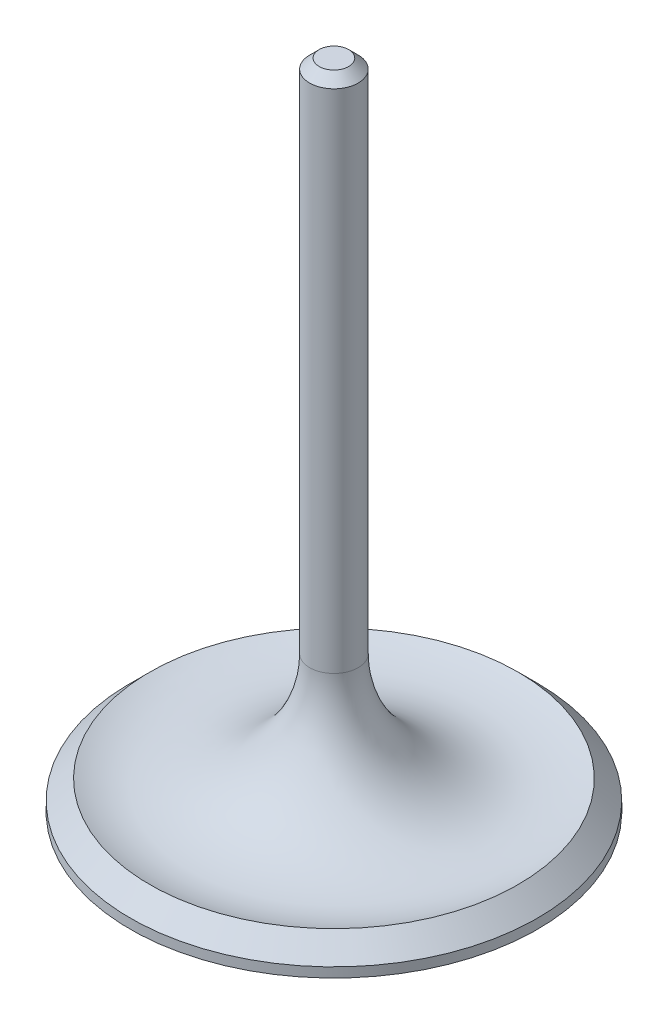
ISO-10303-21;
HEADER;
FILE_DESCRIPTION(('STEP AP214'),'2;1');
FILE_NAME('part.step','',(''),(''),'','','');
FILE_SCHEMA(('AUTOMOTIVE_DESIGN { 1 0 10303 214 1 1 1 1 }'));
ENDSEC;
DATA;
#1=APPLICATION_CONTEXT('core data for automotive mechanical design processes');
#2=APPLICATION_PROTOCOL_DEFINITION('international standard','automotive_design',2000,#1);
#3=PRODUCT_CONTEXT('',#1,'mechanical');
#4=PRODUCT('Part','Part','',(#3));
#5=PRODUCT_RELATED_PRODUCT_CATEGORY('part','',(#4));
#6=PRODUCT_DEFINITION_FORMATION('','',#4);
#7=PRODUCT_DEFINITION_CONTEXT('part definition',#1,'design');
#8=PRODUCT_DEFINITION('design','',#6,#7);
#9=PRODUCT_DEFINITION_SHAPE('','',#8);
#10=(LENGTH_UNIT() NAMED_UNIT(*) SI_UNIT(.MILLI.,.METRE.));
#11=(NAMED_UNIT(*) PLANE_ANGLE_UNIT() SI_UNIT($,.RADIAN.));
#12=(NAMED_UNIT(*) SI_UNIT($,.STERADIAN.) SOLID_ANGLE_UNIT());
#13=UNCERTAINTY_MEASURE_WITH_UNIT(LENGTH_MEASURE(1.E-05),#10,'distance_accuracy_value','');
#14=(GEOMETRIC_REPRESENTATION_CONTEXT(3) GLOBAL_UNCERTAINTY_ASSIGNED_CONTEXT((#13)) GLOBAL_UNIT_ASSIGNED_CONTEXT((#10,
#11,#12)) REPRESENTATION_CONTEXT('',''));
#15=CARTESIAN_POINT('',(0.,0.,0.));
#16=DIRECTION('',(0.,0.,1.));
#17=DIRECTION('',(1.,0.,0.));
#18=AXIS2_PLACEMENT_3D('',#15,#16,#17);
#19=CARTESIAN_POINT('',(0.,0.,-26.67));
#20=DIRECTION('',(0.,-1.,0.));
#21=DIRECTION('',(0.,0.,-1.));
#22=AXIS2_PLACEMENT_3D('',#19,#20,#21);
#23=PLANE('',#22);
#24=CARTESIAN_POINT('',(0.,0.,0.));
#25=DIRECTION('',(0.,-1.,0.));
#26=DIRECTION('',(0.,0.,-1.));
#27=AXIS2_PLACEMENT_3D('',#24,#25,#26);
#28=CIRCLE('',#27,26.67);
#29=CARTESIAN_POINT('',(0.,0.,-26.67));
#30=VERTEX_POINT('',#29);
#31=EDGE_CURVE('E42',#30,#30,#28,.T.);
#32=ORIENTED_EDGE('',*,*,#31,.T.);
#33=EDGE_LOOP('',(#32));
#34=FACE_BOUND('',#33,.T.);
#35=ADVANCED_FACE('F31',(#34),#23,.T.);
#36=CARTESIAN_POINT('',(0.,0.,0.));
#37=DIRECTION('',(0.,-1.,0.));
#38=DIRECTION('',(0.,0.,-1.));
#39=AXIS2_PLACEMENT_3D('',#36,#37,#38);
#40=CYLINDRICAL_SURFACE('',#39,26.67);
#41=CARTESIAN_POINT('',(0.,1.27,0.));
#42=DIRECTION('',(0.,-1.,0.));
#43=DIRECTION('',(0.,0.,-1.));
#44=AXIS2_PLACEMENT_3D('',#41,#42,#43);
#45=CIRCLE('',#44,26.67);
#46=CARTESIAN_POINT('',(0.,1.27,-26.67));
#47=VERTEX_POINT('',#46);
#48=EDGE_CURVE('E46',#47,#47,#45,.T.);
#49=ORIENTED_EDGE('',*,*,#48,.T.);
#50=EDGE_LOOP('',(#49));
#51=FACE_BOUND('',#50,.T.);
#52=ORIENTED_EDGE('',*,*,#31,.F.);
#53=EDGE_LOOP('',(#52));
#54=FACE_BOUND('',#53,.T.);
#55=ADVANCED_FACE('F73',(#51,#54),#40,.T.);
#56=CARTESIAN_POINT('',(0.,1.27,0.));
#57=DIRECTION('',(0.,-1.,0.));
#58=DIRECTION('',(0.,0.,-1.));
#59=AXIS2_PLACEMENT_3D('',#56,#57,#58);
#60=CONICAL_SURFACE('',#59,26.67,0.785398163397454);
#61=CARTESIAN_POINT('',(0.,3.81,0.));
#62=DIRECTION('',(0.,-1.,0.));
#63=DIRECTION('',(0.,0.,-1.));
#64=AXIS2_PLACEMENT_3D('',#61,#62,#63);
#65=CIRCLE('',#64,24.13);
#66=CARTESIAN_POINT('',(0.,3.81,-24.13));
#67=VERTEX_POINT('',#66);
#68=EDGE_CURVE('E51',#67,#67,#65,.T.);
#69=ORIENTED_EDGE('',*,*,#68,.T.);
#70=EDGE_LOOP('',(#69));
#71=FACE_BOUND('',#70,.T.);
#72=ORIENTED_EDGE('',*,*,#48,.F.);
#73=EDGE_LOOP('',(#72));
#74=FACE_BOUND('',#73,.T.);
#75=ADVANCED_FACE('F70',(#71,#74),#60,.T.);
#76=CARTESIAN_POINT('',(0.,17.9546986535592,0.));
#77=DIRECTION('',(0.,-1.,0.));
#78=DIRECTION('',(0.,0.,-1.));
#79=AXIS2_PLACEMENT_3D('',#76,#77,#78);
#80=TOROIDAL_SURFACE('',#79,18.43,15.25);
#81=CARTESIAN_POINT('',(0.,17.9546986535592,0.));
#82=DIRECTION('',(0.,-1.,0.));
#83=DIRECTION('',(0.,0.,-1.));
#84=AXIS2_PLACEMENT_3D('',#81,#82,#83);
#85=CIRCLE('',#84,3.18000000000001);
#86=CARTESIAN_POINT('',(0.,17.9546986535592,-3.18000000000001));
#87=VERTEX_POINT('',#86);
#88=EDGE_CURVE('E54',#87,#87,#85,.T.);
#89=ORIENTED_EDGE('',*,*,#88,.T.);
#90=EDGE_LOOP('',(#89));
#91=FACE_BOUND('',#90,.T.);
#92=ORIENTED_EDGE('',*,*,#68,.F.);
#93=EDGE_LOOP('',(#92));
#94=FACE_BOUND('',#93,.T.);
#95=ADVANCED_FACE('F58',(#91,#94),#80,.F.);
#96=CARTESIAN_POINT('',(0.,0.,0.));
#97=DIRECTION('',(0.,-1.,0.));
#98=DIRECTION('',(0.,0.,-1.));
#99=AXIS2_PLACEMENT_3D('',#96,#97,#98);
#100=CYLINDRICAL_SURFACE('',#99,3.18000000000001);
#101=CARTESIAN_POINT('',(0.,84.3,0.));
#102=DIRECTION('',(0.,1.,0.));
#103=DIRECTION('',(0.,0.,1.));
#104=AXIS2_PLACEMENT_3D('',#101,#102,#103);
#105=CIRCLE('',#104,3.18000000000001);
#106=CARTESIAN_POINT('',(0.,84.3,3.18000000000001));
#107=VERTEX_POINT('',#106);
#108=EDGE_CURVE('E38',#107,#107,#105,.F.);
#109=ORIENTED_EDGE('',*,*,#108,.T.);
#110=EDGE_LOOP('',(#109));
#111=FACE_BOUND('',#110,.T.);
#112=ORIENTED_EDGE('',*,*,#88,.F.);
#113=EDGE_LOOP('',(#112));
#114=FACE_BOUND('',#113,.T.);
#115=ADVANCED_FACE('F61',(#111,#114),#100,.T.);
#116=CARTESIAN_POINT('',(0.,85.55,0.));
#117=DIRECTION('',(0.,1.,0.));
#118=DIRECTION('',(0.,0.,1.));
#119=AXIS2_PLACEMENT_3D('',#116,#117,#118);
#120=PLANE('',#119);
#121=CARTESIAN_POINT('',(0.,85.55,0.));
#122=DIRECTION('',(0.,1.,0.));
#123=DIRECTION('',(0.,0.,1.));
#124=AXIS2_PLACEMENT_3D('',#121,#122,#123);
#125=CIRCLE('',#124,1.92999999999999);
#126=CARTESIAN_POINT('',(0.,85.55,1.92999999999999));
#127=VERTEX_POINT('',#126);
#128=EDGE_CURVE('E10',#127,#127,#125,.T.);
#129=ORIENTED_EDGE('',*,*,#128,.T.);
#130=EDGE_LOOP('',(#129));
#131=FACE_BOUND('',#130,.T.);
#132=ADVANCED_FACE('F63',(#131),#120,.T.);
#133=CARTESIAN_POINT('',(0.,84.3,0.));
#134=DIRECTION('',(0.,-1.,0.));
#135=DIRECTION('',(0.,0.,-1.));
#136=AXIS2_PLACEMENT_3D('',#133,#134,#135);
#137=CONICAL_SURFACE('',#136,3.18000000000001,0.785398163397444);
#138=ORIENTED_EDGE('',*,*,#128,.F.);
#139=EDGE_LOOP('',(#138));
#140=FACE_BOUND('',#139,.T.);
#141=ORIENTED_EDGE('',*,*,#108,.F.);
#142=EDGE_LOOP('',(#141));
#143=FACE_BOUND('',#142,.T.);
#144=ADVANCED_FACE('F33',(#140,#143),#137,.T.);
#145=CLOSED_SHELL('',(#35,#55,#75,#95,#115,#132,#144));
#146=MANIFOLD_SOLID_BREP('B2',#145);
#147=ADVANCED_BREP_SHAPE_REPRESENTATION('',(#18,#146),#14);
#148=SHAPE_DEFINITION_REPRESENTATION(#9,#147);
ENDSEC;
END-ISO-10303-21;
